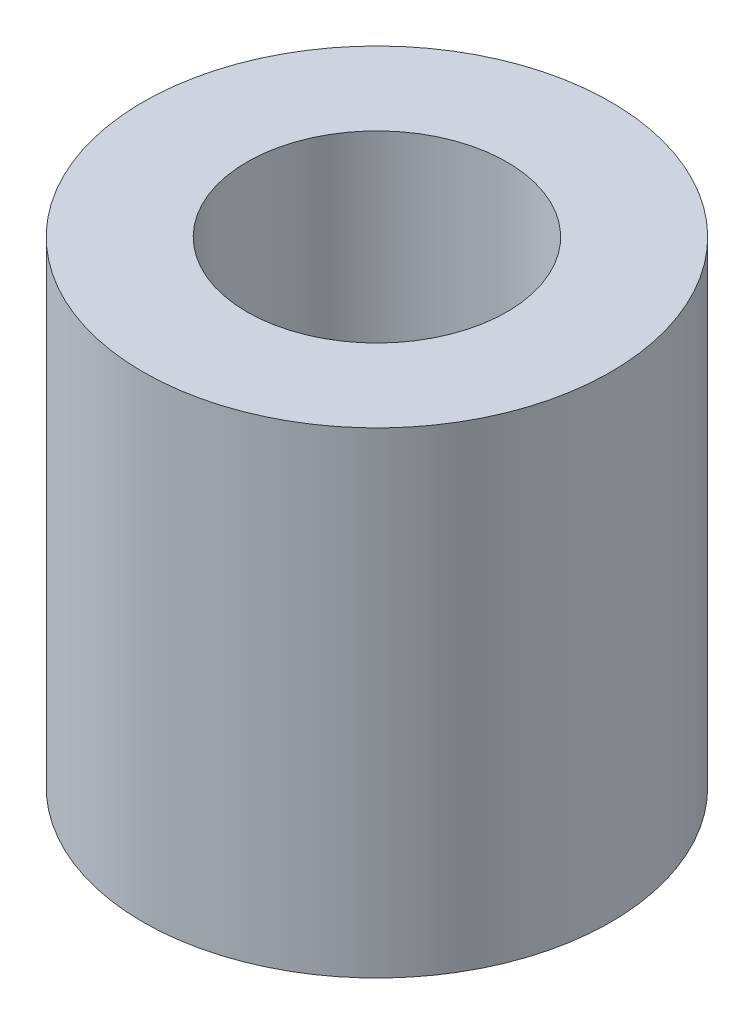
ISO-10303-21;
HEADER;
FILE_DESCRIPTION(('STEP AP214'),'2;1');
FILE_NAME('part.step','',(''),(''),'','','');
FILE_SCHEMA(('AUTOMOTIVE_DESIGN { 1 0 10303 214 1 1 1 1 }'));
ENDSEC;
DATA;
#1=APPLICATION_CONTEXT('core data for automotive mechanical design processes');
#2=APPLICATION_PROTOCOL_DEFINITION('international standard','automotive_design',2000,#1);
#3=PRODUCT_CONTEXT('',#1,'mechanical');
#4=PRODUCT('Part','Part','',(#3));
#5=PRODUCT_RELATED_PRODUCT_CATEGORY('part','',(#4));
#6=PRODUCT_DEFINITION_FORMATION('','',#4);
#7=PRODUCT_DEFINITION_CONTEXT('part definition',#1,'design');
#8=PRODUCT_DEFINITION('design','',#6,#7);
#9=PRODUCT_DEFINITION_SHAPE('','',#8);
#10=(LENGTH_UNIT() NAMED_UNIT(*) SI_UNIT(.MILLI.,.METRE.));
#11=(NAMED_UNIT(*) PLANE_ANGLE_UNIT() SI_UNIT($,.RADIAN.));
#12=(NAMED_UNIT(*) SI_UNIT($,.STERADIAN.) SOLID_ANGLE_UNIT());
#13=UNCERTAINTY_MEASURE_WITH_UNIT(LENGTH_MEASURE(1.E-05),#10,'distance_accuracy_value','');
#14=(GEOMETRIC_REPRESENTATION_CONTEXT(3) GLOBAL_UNCERTAINTY_ASSIGNED_CONTEXT((#13)) GLOBAL_UNIT_ASSIGNED_CONTEXT((#10,
#11,#12)) REPRESENTATION_CONTEXT('',''));
#15=CARTESIAN_POINT('',(0.,0.,0.));
#16=DIRECTION('',(0.,0.,1.));
#17=DIRECTION('',(1.,0.,0.));
#18=AXIS2_PLACEMENT_3D('',#15,#16,#17);
#19=CARTESIAN_POINT('',(0.,5.5,0.));
#20=DIRECTION('',(0.,1.,0.));
#21=DIRECTION('',(0.,0.,1.));
#22=AXIS2_PLACEMENT_3D('',#19,#20,#21);
#23=PLANE('',#22);
#24=CARTESIAN_POINT('',(0.,5.5,0.));
#25=DIRECTION('',(0.,1.,0.));
#26=DIRECTION('',(0.,0.,1.));
#27=AXIS2_PLACEMENT_3D('',#24,#25,#26);
#28=CIRCLE('',#27,2.7);
#29=CARTESIAN_POINT('',(0.,5.5,2.7));
#30=VERTEX_POINT('',#29);
#31=EDGE_CURVE('E10',#30,#30,#28,.T.);
#32=ORIENTED_EDGE('',*,*,#31,.T.);
#33=EDGE_LOOP('',(#32));
#34=FACE_BOUND('',#33,.T.);
#35=CARTESIAN_POINT('',(0.,5.5,0.));
#36=DIRECTION('',(0.,1.,0.));
#37=DIRECTION('',(0.,0.,1.));
#38=AXIS2_PLACEMENT_3D('',#35,#36,#37);
#39=CIRCLE('',#38,1.5);
#40=CARTESIAN_POINT('',(0.,5.5,1.5));
#41=VERTEX_POINT('',#40);
#42=EDGE_CURVE('E44',#41,#41,#39,.T.);
#43=ORIENTED_EDGE('',*,*,#42,.F.);
#44=EDGE_LOOP('',(#43));
#45=FACE_BOUND('',#44,.T.);
#46=ADVANCED_FACE('F33',(#34,#45),#23,.T.);
#47=CARTESIAN_POINT('',(0.,0.,0.));
#48=DIRECTION('',(0.,1.,0.));
#49=DIRECTION('',(0.,0.,1.));
#50=AXIS2_PLACEMENT_3D('',#47,#48,#49);
#51=PLANE('',#50);
#52=CARTESIAN_POINT('',(0.,0.,0.));
#53=DIRECTION('',(0.,1.,0.));
#54=DIRECTION('',(0.,0.,1.));
#55=AXIS2_PLACEMENT_3D('',#52,#53,#54);
#56=CIRCLE('',#55,2.7);
#57=CARTESIAN_POINT('',(0.,0.,2.7));
#58=VERTEX_POINT('',#57);
#59=EDGE_CURVE('E37',#58,#58,#56,.T.);
#60=ORIENTED_EDGE('',*,*,#59,.F.);
#61=EDGE_LOOP('',(#60));
#62=FACE_BOUND('',#61,.T.);
#63=CARTESIAN_POINT('',(0.,0.,0.));
#64=DIRECTION('',(0.,1.,0.));
#65=DIRECTION('',(0.,0.,1.));
#66=AXIS2_PLACEMENT_3D('',#63,#64,#65);
#67=CIRCLE('',#66,1.5);
#68=CARTESIAN_POINT('',(0.,0.,1.5));
#69=VERTEX_POINT('',#68);
#70=EDGE_CURVE('E46',#69,#69,#67,.T.);
#71=ORIENTED_EDGE('',*,*,#70,.T.);
#72=EDGE_LOOP('',(#71));
#73=FACE_BOUND('',#72,.T.);
#74=ADVANCED_FACE('F56',(#62,#73),#51,.F.);
#75=CARTESIAN_POINT('',(0.,5.5,0.));
#76=DIRECTION('',(0.,-1.,0.));
#77=DIRECTION('',(0.,0.,-1.));
#78=AXIS2_PLACEMENT_3D('',#75,#76,#77);
#79=CYLINDRICAL_SURFACE('',#78,2.7);
#80=ORIENTED_EDGE('',*,*,#31,.F.);
#81=EDGE_LOOP('',(#80));
#82=FACE_BOUND('',#81,.T.);
#83=ORIENTED_EDGE('',*,*,#59,.T.);
#84=EDGE_LOOP('',(#83));
#85=FACE_BOUND('',#84,.T.);
#86=ADVANCED_FACE('F35',(#82,#85),#79,.T.);
#87=CARTESIAN_POINT('',(0.,5.5,0.));
#88=DIRECTION('',(0.,-1.,0.));
#89=DIRECTION('',(0.,0.,-1.));
#90=AXIS2_PLACEMENT_3D('',#87,#88,#89);
#91=CYLINDRICAL_SURFACE('',#90,1.5);
#92=ORIENTED_EDGE('',*,*,#42,.T.);
#93=EDGE_LOOP('',(#92));
#94=FACE_BOUND('',#93,.T.);
#95=ORIENTED_EDGE('',*,*,#70,.F.);
#96=EDGE_LOOP('',(#95));
#97=FACE_BOUND('',#96,.T.);
#98=ADVANCED_FACE('F52',(#94,#97),#91,.F.);
#99=CLOSED_SHELL('',(#46,#74,#86,#98));
#100=MANIFOLD_SOLID_BREP('B2',#99);
#101=ADVANCED_BREP_SHAPE_REPRESENTATION('',(#18,#100),#14);
#102=SHAPE_DEFINITION_REPRESENTATION(#9,#101);
ENDSEC;
END-ISO-10303-21;
